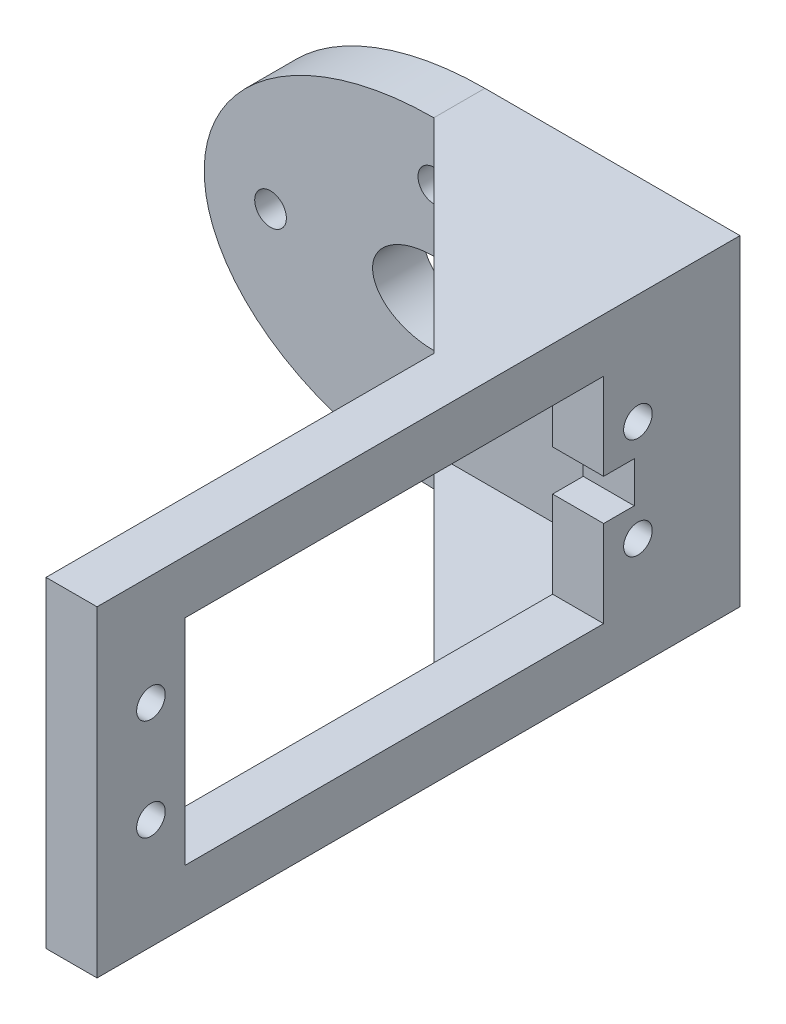
ISO-10303-21;
HEADER;
FILE_DESCRIPTION(('STEP AP214'),'2;1');
FILE_NAME('part.step','',(''),(''),'','','');
FILE_SCHEMA(('AUTOMOTIVE_DESIGN { 1 0 10303 214 1 1 1 1 }'));
ENDSEC;
DATA;
#1=APPLICATION_CONTEXT('core data for automotive mechanical design processes');
#2=APPLICATION_PROTOCOL_DEFINITION('international standard','automotive_design',2000,#1);
#3=PRODUCT_CONTEXT('',#1,'mechanical');
#4=PRODUCT('Part','Part','',(#3));
#5=PRODUCT_RELATED_PRODUCT_CATEGORY('part','',(#4));
#6=PRODUCT_DEFINITION_FORMATION('','',#4);
#7=PRODUCT_DEFINITION_CONTEXT('part definition',#1,'design');
#8=PRODUCT_DEFINITION('design','',#6,#7);
#9=PRODUCT_DEFINITION_SHAPE('','',#8);
#10=(LENGTH_UNIT() NAMED_UNIT(*) SI_UNIT(.MILLI.,.METRE.));
#11=(NAMED_UNIT(*) PLANE_ANGLE_UNIT() SI_UNIT($,.RADIAN.));
#12=(NAMED_UNIT(*) SI_UNIT($,.STERADIAN.) SOLID_ANGLE_UNIT());
#13=UNCERTAINTY_MEASURE_WITH_UNIT(LENGTH_MEASURE(1.E-05),#10,'distance_accuracy_value','');
#14=(GEOMETRIC_REPRESENTATION_CONTEXT(3) GLOBAL_UNCERTAINTY_ASSIGNED_CONTEXT((#13)) GLOBAL_UNIT_ASSIGNED_CONTEXT((#10,
#11,#12)) REPRESENTATION_CONTEXT('',''));
#15=CARTESIAN_POINT('',(0.,0.,0.));
#16=DIRECTION('',(0.,0.,1.));
#17=DIRECTION('',(1.,0.,0.));
#18=AXIS2_PLACEMENT_3D('',#15,#16,#17);
#19=CARTESIAN_POINT('',(0.,0.,5.));
#20=DIRECTION('',(0.,0.,1.));
#21=DIRECTION('',(1.,0.,0.));
#22=AXIS2_PLACEMENT_3D('',#19,#20,#21);
#23=PLANE('',#22);
#24=CARTESIAN_POINT('',(0.,-10.,5.));
#25=DIRECTION('',(0.,0.,1.));
#26=DIRECTION('',(1.,0.,0.));
#27=AXIS2_PLACEMENT_3D('',#24,#25,#26);
#28=CIRCLE('',#27,1.55);
#29=CARTESIAN_POINT('',(1.55,-10.,5.));
#30=VERTEX_POINT('',#29);
#31=EDGE_CURVE('E353',#30,#30,#28,.T.);
#32=ORIENTED_EDGE('',*,*,#31,.F.);
#33=EDGE_LOOP('',(#32));
#34=FACE_BOUND('',#33,.T.);
#35=CARTESIAN_POINT('',(-16.,0.,5.));
#36=DIRECTION('',(0.,0.,1.));
#37=DIRECTION('',(1.,0.,0.));
#38=AXIS2_PLACEMENT_3D('',#35,#36,#37);
#39=CIRCLE('',#38,1.55);
#40=CARTESIAN_POINT('',(-14.45,0.,5.));
#41=VERTEX_POINT('',#40);
#42=EDGE_CURVE('E839',#41,#41,#39,.T.);
#43=ORIENTED_EDGE('',*,*,#42,.F.);
#44=EDGE_LOOP('',(#43));
#45=FACE_BOUND('',#44,.T.);
#46=CARTESIAN_POINT('',(16.,0.,5.));
#47=DIRECTION('',(0.,0.,1.));
#48=DIRECTION('',(1.,0.,0.));
#49=AXIS2_PLACEMENT_3D('',#46,#47,#48);
#50=CIRCLE('',#49,1.55);
#51=CARTESIAN_POINT('',(17.55,0.,5.));
#52=VERTEX_POINT('',#51);
#53=EDGE_CURVE('E842',#52,#52,#50,.T.);
#54=ORIENTED_EDGE('',*,*,#53,.F.);
#55=EDGE_LOOP('',(#54));
#56=FACE_BOUND('',#55,.T.);
#57=CARTESIAN_POINT('',(0.,10.,5.));
#58=DIRECTION('',(0.,0.,1.));
#59=DIRECTION('',(1.,0.,0.));
#60=AXIS2_PLACEMENT_3D('',#57,#58,#59);
#61=CIRCLE('',#60,1.55);
#62=CARTESIAN_POINT('',(1.55,10.,5.));
#63=VERTEX_POINT('',#62);
#64=EDGE_CURVE('E396',#63,#63,#61,.T.);
#65=ORIENTED_EDGE('',*,*,#64,.F.);
#66=EDGE_LOOP('',(#65));
#67=FACE_BOUND('',#66,.T.);
#68=CARTESIAN_POINT('',(0.,0.,5.));
#69=DIRECTION('',(0.,0.,1.));
#70=DIRECTION('',(1.,0.,0.));
#71=AXIS2_PLACEMENT_3D('',#68,#69,#70);
#72=ELLIPSE('',#71,6.,4.);
#73=CARTESIAN_POINT('',(6.,0.,5.));
#74=VERTEX_POINT('',#73);
#75=EDGE_CURVE('E389',#74,#74,#72,.T.);
#76=ORIENTED_EDGE('',*,*,#75,.F.);
#77=EDGE_LOOP('',(#76));
#78=FACE_BOUND('',#77,.T.);
#79=CARTESIAN_POINT('',(0.,0.,5.));
#80=DIRECTION('',(0.,0.,1.));
#81=DIRECTION('',(1.,0.,0.));
#82=AXIS2_PLACEMENT_3D('',#79,#80,#81);
#83=ELLIPSE('',#82,22.5,15.75);
#84=CARTESIAN_POINT('',(0.,15.75,5.));
#85=VERTEX_POINT('',#84);
#86=CARTESIAN_POINT('',(0.,-15.75,5.));
#87=VERTEX_POINT('',#86);
#88=EDGE_CURVE('E348',#85,#87,#83,.T.);
#89=ORIENTED_EDGE('',*,*,#88,.T.);
#90=DIRECTION('',(0.,-1.,0.));
#91=VECTOR('',#90,1.);
#92=CARTESIAN_POINT('',(0.,-12.75,5.));
#93=LINE('',#92,#91);
#94=CARTESIAN_POINT('',(0.,-12.75,5.));
#95=VERTEX_POINT('',#94);
#96=EDGE_CURVE('E260',#95,#87,#93,.T.);
#97=ORIENTED_EDGE('',*,*,#96,.F.);
#98=DIRECTION('',(-1.,0.,0.));
#99=VECTOR('',#98,1.);
#100=CARTESIAN_POINT('',(0.,-12.75,5.));
#101=LINE('',#100,#99);
#102=CARTESIAN_POINT('',(20.,-12.75,5.));
#103=VERTEX_POINT('',#102);
#104=EDGE_CURVE('E254',#103,#95,#101,.T.);
#105=ORIENTED_EDGE('',*,*,#104,.F.);
#106=DIRECTION('',(0.,-1.,0.));
#107=VECTOR('',#106,1.);
#108=CARTESIAN_POINT('',(20.,15.75,5.));
#109=LINE('',#108,#107);
#110=CARTESIAN_POINT('',(20.,12.75,5.));
#111=VERTEX_POINT('',#110);
#112=EDGE_CURVE('E319',#111,#103,#109,.T.);
#113=ORIENTED_EDGE('',*,*,#112,.F.);
#114=DIRECTION('',(-1.,0.,0.));
#115=VECTOR('',#114,1.);
#116=CARTESIAN_POINT('',(0.,12.75,5.));
#117=LINE('',#116,#115);
#118=CARTESIAN_POINT('',(0.,12.75,5.));
#119=VERTEX_POINT('',#118);
#120=EDGE_CURVE('E277',#111,#119,#117,.T.);
#121=ORIENTED_EDGE('',*,*,#120,.T.);
#122=DIRECTION('',(0.,1.,0.));
#123=VECTOR('',#122,1.);
#124=CARTESIAN_POINT('',(0.,12.75,5.));
#125=LINE('',#124,#123);
#126=EDGE_CURVE('E284',#119,#85,#125,.T.);
#127=ORIENTED_EDGE('',*,*,#126,.T.);
#128=EDGE_LOOP('',(#89,#97,#105,#113,#121,#127));
#129=FACE_BOUND('',#128,.T.);
#130=ADVANCED_FACE('F44',(#34,#45,#56,#67,#78,#129),#23,.T.);
#131=CARTESIAN_POINT('',(20.,15.75,63.));
#132=DIRECTION('',(1.,0.,0.));
#133=DIRECTION('',(0.,1.,0.));
#134=AXIS2_PLACEMENT_3D('',#131,#132,#133);
#135=PLANE('',#134);
#136=DIRECTION('',(0.,-1.,0.));
#137=VECTOR('',#136,1.);
#138=CARTESIAN_POINT('',(20.,0.,10.36));
#139=LINE('',#138,#137);
#140=CARTESIAN_POINT('',(20.,2.,10.36));
#141=VERTEX_POINT('',#140);
#142=CARTESIAN_POINT('',(20.,-2.,10.36));
#143=VERTEX_POINT('',#142);
#144=EDGE_CURVE('E210',#141,#143,#139,.T.);
#145=ORIENTED_EDGE('',*,*,#144,.F.);
#146=DIRECTION('',(0.,0.,-1.));
#147=VECTOR('',#146,1.);
#148=CARTESIAN_POINT('',(20.,2.,0.));
#149=LINE('',#148,#147);
#150=CARTESIAN_POINT('',(20.,2.,13.36));
#151=VERTEX_POINT('',#150);
#152=EDGE_CURVE('E60',#151,#141,#149,.T.);
#153=ORIENTED_EDGE('',*,*,#152,.F.);
#154=DIRECTION('',(0.,1.,0.));
#155=VECTOR('',#154,1.);
#156=CARTESIAN_POINT('',(20.,0.,13.36));
#157=LINE('',#156,#155);
#158=CARTESIAN_POINT('',(20.,10.5,13.36));
#159=VERTEX_POINT('',#158);
#160=EDGE_CURVE('E184',#151,#159,#157,.T.);
#161=ORIENTED_EDGE('',*,*,#160,.T.);
#162=DIRECTION('',(0.,0.,1.));
#163=VECTOR('',#162,1.);
#164=CARTESIAN_POINT('',(20.,10.5,0.));
#165=LINE('',#164,#163);
#166=CARTESIAN_POINT('',(20.,10.5,54.36));
#167=VERTEX_POINT('',#166);
#168=EDGE_CURVE('E188',#159,#167,#165,.T.);
#169=ORIENTED_EDGE('',*,*,#168,.T.);
#170=DIRECTION('',(0.,1.,0.));
#171=VECTOR('',#170,1.);
#172=CARTESIAN_POINT('',(20.,0.,54.36));
#173=LINE('',#172,#171);
#174=CARTESIAN_POINT('',(20.,-10.5,54.36));
#175=VERTEX_POINT('',#174);
#176=EDGE_CURVE('E223',#175,#167,#173,.T.);
#177=ORIENTED_EDGE('',*,*,#176,.F.);
#178=DIRECTION('',(0.,0.,1.));
#179=VECTOR('',#178,1.);
#180=CARTESIAN_POINT('',(20.,-10.5,0.));
#181=LINE('',#180,#179);
#182=CARTESIAN_POINT('',(20.,-10.5,13.36));
#183=VERTEX_POINT('',#182);
#184=EDGE_CURVE('E219',#183,#175,#181,.T.);
#185=ORIENTED_EDGE('',*,*,#184,.F.);
#186=CARTESIAN_POINT('',(20.,-2.,13.36));
#187=VERTEX_POINT('',#186);
#188=EDGE_CURVE('E190',#183,#187,#157,.T.);
#189=ORIENTED_EDGE('',*,*,#188,.T.);
#190=DIRECTION('',(0.,0.,-1.));
#191=VECTOR('',#190,1.);
#192=CARTESIAN_POINT('',(20.,-2.,0.));
#193=LINE('',#192,#191);
#194=EDGE_CURVE('E213',#187,#143,#193,.T.);
#195=ORIENTED_EDGE('',*,*,#194,.T.);
#196=EDGE_LOOP('',(#145,#153,#161,#169,#177,#185,#189,#195));
#197=FACE_BOUND('',#196,.T.);
#198=CARTESIAN_POINT('',(20.,4.96,10.));
#199=DIRECTION('',(-1.,0.,0.));
#200=DIRECTION('',(0.,-1.,0.));
#201=AXIS2_PLACEMENT_3D('',#198,#199,#200);
#202=CIRCLE('',#201,1.4);
#203=CARTESIAN_POINT('',(20.,3.56,10.));
#204=VERTEX_POINT('',#203);
#205=EDGE_CURVE('E295',#204,#204,#202,.T.);
#206=ORIENTED_EDGE('',*,*,#205,.F.);
#207=EDGE_LOOP('',(#206));
#208=FACE_BOUND('',#207,.T.);
#209=CARTESIAN_POINT('',(20.,-4.96,10.));
#210=DIRECTION('',(-1.,0.,0.));
#211=DIRECTION('',(0.,-1.,0.));
#212=AXIS2_PLACEMENT_3D('',#209,#210,#211);
#213=CIRCLE('',#212,1.4);
#214=CARTESIAN_POINT('',(20.,-6.36,10.));
#215=VERTEX_POINT('',#214);
#216=EDGE_CURVE('E291',#215,#215,#213,.T.);
#217=ORIENTED_EDGE('',*,*,#216,.F.);
#218=EDGE_LOOP('',(#217));
#219=FACE_BOUND('',#218,.T.);
#220=CARTESIAN_POINT('',(20.,-4.96,57.72));
#221=DIRECTION('',(-1.,0.,0.));
#222=DIRECTION('',(0.,-1.,0.));
#223=AXIS2_PLACEMENT_3D('',#220,#221,#222);
#224=CIRCLE('',#223,1.4);
#225=CARTESIAN_POINT('',(20.,-6.35999999999999,57.72));
#226=VERTEX_POINT('',#225);
#227=EDGE_CURVE('E300',#226,#226,#224,.T.);
#228=ORIENTED_EDGE('',*,*,#227,.F.);
#229=EDGE_LOOP('',(#228));
#230=FACE_BOUND('',#229,.T.);
#231=CARTESIAN_POINT('',(20.,4.96,57.72));
#232=DIRECTION('',(-1.,0.,0.));
#233=DIRECTION('',(0.,-1.,0.));
#234=AXIS2_PLACEMENT_3D('',#231,#232,#233);
#235=CIRCLE('',#234,1.4);
#236=CARTESIAN_POINT('',(20.,3.56000000000001,57.72));
#237=VERTEX_POINT('',#236);
#238=EDGE_CURVE('E308',#237,#237,#235,.T.);
#239=ORIENTED_EDGE('',*,*,#238,.F.);
#240=EDGE_LOOP('',(#239));
#241=FACE_BOUND('',#240,.T.);
#242=DIRECTION('',(0.,-1.,0.));
#243=VECTOR('',#242,1.);
#244=CARTESIAN_POINT('',(20.,-12.75,25.));
#245=LINE('',#244,#243);
#246=CARTESIAN_POINT('',(20.,-12.75,25.));
#247=VERTEX_POINT('',#246);
#248=CARTESIAN_POINT('',(20.,-15.75,25.));
#249=VERTEX_POINT('',#248);
#250=EDGE_CURVE('E263',#247,#249,#245,.T.);
#251=ORIENTED_EDGE('',*,*,#250,.T.);
#252=DIRECTION('',(0.,0.,-1.));
#253=VECTOR('',#252,1.);
#254=CARTESIAN_POINT('',(20.,-15.75,63.));
#255=LINE('',#254,#253);
#256=CARTESIAN_POINT('',(20.,-15.75,63.));
#257=VERTEX_POINT('',#256);
#258=EDGE_CURVE('E337',#257,#249,#255,.T.);
#259=ORIENTED_EDGE('',*,*,#258,.F.);
#260=DIRECTION('',(0.,-1.,0.));
#261=VECTOR('',#260,1.);
#262=CARTESIAN_POINT('',(20.,15.75,63.));
#263=LINE('',#262,#261);
#264=CARTESIAN_POINT('',(20.,15.75,63.));
#265=VERTEX_POINT('',#264);
#266=EDGE_CURVE('E330',#265,#257,#263,.T.);
#267=ORIENTED_EDGE('',*,*,#266,.F.);
#268=DIRECTION('',(0.,0.,-1.));
#269=VECTOR('',#268,1.);
#270=CARTESIAN_POINT('',(20.,15.75,63.));
#271=LINE('',#270,#269);
#272=CARTESIAN_POINT('',(20.,15.75,25.));
#273=VERTEX_POINT('',#272);
#274=EDGE_CURVE('E344',#265,#273,#271,.T.);
#275=ORIENTED_EDGE('',*,*,#274,.T.);
#276=DIRECTION('',(0.,1.,0.));
#277=VECTOR('',#276,1.);
#278=CARTESIAN_POINT('',(20.,12.75,25.));
#279=LINE('',#278,#277);
#280=CARTESIAN_POINT('',(20.,12.75,25.));
#281=VERTEX_POINT('',#280);
#282=EDGE_CURVE('E280',#281,#273,#279,.T.);
#283=ORIENTED_EDGE('',*,*,#282,.F.);
#284=DIRECTION('',(0.,0.,-1.));
#285=VECTOR('',#284,1.);
#286=CARTESIAN_POINT('',(20.,12.75,5.));
#287=LINE('',#286,#285);
#288=EDGE_CURVE('E274',#281,#111,#287,.T.);
#289=ORIENTED_EDGE('',*,*,#288,.T.);
#290=ORIENTED_EDGE('',*,*,#112,.T.);
#291=DIRECTION('',(0.,0.,-1.));
#292=VECTOR('',#291,1.);
#293=CARTESIAN_POINT('',(20.,-12.75,5.));
#294=LINE('',#293,#292);
#295=EDGE_CURVE('E257',#247,#103,#294,.T.);
#296=ORIENTED_EDGE('',*,*,#295,.F.);
#297=EDGE_LOOP('',(#251,#259,#267,#275,#283,#289,#290,#296));
#298=FACE_BOUND('',#297,.T.);
#299=ADVANCED_FACE('F456',(#197,#208,#219,#230,#241,#298),#135,.F.);
#300=CARTESIAN_POINT('',(0.,15.75,5.));
#301=DIRECTION('',(0.,-1.,0.));
#302=DIRECTION('',(1.,0.,0.));
#303=AXIS2_PLACEMENT_3D('',#300,#301,#302);
#304=PLANE('',#303);
#305=DIRECTION('',(0.,0.,-1.));
#306=VECTOR('',#305,1.);
#307=CARTESIAN_POINT('',(0.,15.75,5.));
#308=LINE('',#307,#306);
#309=CARTESIAN_POINT('',(0.,15.75,0.));
#310=VERTEX_POINT('',#309);
#311=EDGE_CURVE('E11',#85,#310,#308,.T.);
#312=ORIENTED_EDGE('',*,*,#311,.F.);
#313=DIRECTION('',(0.707106781186548,0.,0.707106781186547));
#314=VECTOR('',#313,1.);
#315=CARTESIAN_POINT('',(20.,15.75,25.));
#316=LINE('',#315,#314);
#317=EDGE_CURVE('E267',#85,#273,#316,.T.);
#318=ORIENTED_EDGE('',*,*,#317,.T.);
#319=ORIENTED_EDGE('',*,*,#274,.F.);
#320=DIRECTION('',(-1.,0.,0.));
#321=VECTOR('',#320,1.);
#322=CARTESIAN_POINT('',(25.,15.75,63.));
#323=LINE('',#322,#321);
#324=CARTESIAN_POINT('',(25.,15.75,63.));
#325=VERTEX_POINT('',#324);
#326=EDGE_CURVE('E327',#325,#265,#323,.T.);
#327=ORIENTED_EDGE('',*,*,#326,.F.);
#328=DIRECTION('',(0.,0.,-1.));
#329=VECTOR('',#328,1.);
#330=CARTESIAN_POINT('',(25.,15.75,5.));
#331=LINE('',#330,#329);
#332=CARTESIAN_POINT('',(25.,15.75,0.));
#333=VERTEX_POINT('',#332);
#334=EDGE_CURVE('E395',#325,#333,#331,.T.);
#335=ORIENTED_EDGE('',*,*,#334,.T.);
#336=DIRECTION('',(-1.,0.,0.));
#337=VECTOR('',#336,1.);
#338=CARTESIAN_POINT('',(0.,15.75,0.));
#339=LINE('',#338,#337);
#340=EDGE_CURVE('E347',#333,#310,#339,.T.);
#341=ORIENTED_EDGE('',*,*,#340,.T.);
#342=EDGE_LOOP('',(#312,#318,#319,#327,#335,#341));
#343=FACE_BOUND('',#342,.T.);
#344=ADVANCED_FACE('F46',(#343),#304,.F.);
#345=DIRECTION('',(0.,0.,-1.));
#346=VECTOR('',#345,1.);
#347=SURFACE_OF_LINEAR_EXTRUSION('',#83,#346);
#348=CARTESIAN_POINT('',(0.,0.,0.));
#349=DIRECTION('',(0.,0.,1.));
#350=DIRECTION('',(1.,0.,0.));
#351=AXIS2_PLACEMENT_3D('',#348,#349,#350);
#352=ELLIPSE('',#351,22.5,15.75);
#353=CARTESIAN_POINT('',(0.,-15.75,0.));
#354=VERTEX_POINT('',#353);
#355=EDGE_CURVE('E401',#310,#354,#352,.T.);
#356=ORIENTED_EDGE('',*,*,#355,.T.);
#357=DIRECTION('',(0.,0.,-1.));
#358=VECTOR('',#357,1.);
#359=CARTESIAN_POINT('',(0.,-15.75,5.));
#360=LINE('',#359,#358);
#361=EDGE_CURVE('E53',#87,#354,#360,.T.);
#362=ORIENTED_EDGE('',*,*,#361,.F.);
#363=ORIENTED_EDGE('',*,*,#88,.F.);
#364=ORIENTED_EDGE('',*,*,#311,.T.);
#365=EDGE_LOOP('',(#356,#362,#363,#364));
#366=FACE_BOUND('',#365,.T.);
#367=ADVANCED_FACE('F356',(#366),#347,.F.);
#368=CARTESIAN_POINT('',(0.,-15.75,5.));
#369=DIRECTION('',(0.,-1.,0.));
#370=DIRECTION('',(1.,0.,0.));
#371=AXIS2_PLACEMENT_3D('',#368,#369,#370);
#372=PLANE('',#371);
#373=DIRECTION('',(0.707106781186548,0.,0.707106781186547));
#374=VECTOR('',#373,1.);
#375=CARTESIAN_POINT('',(20.,-15.75,25.));
#376=LINE('',#375,#374);
#377=EDGE_CURVE('E233',#87,#249,#376,.T.);
#378=ORIENTED_EDGE('',*,*,#377,.F.);
#379=ORIENTED_EDGE('',*,*,#361,.T.);
#380=DIRECTION('',(-1.,0.,0.));
#381=VECTOR('',#380,1.);
#382=CARTESIAN_POINT('',(0.,-15.75,0.));
#383=LINE('',#382,#381);
#384=CARTESIAN_POINT('',(25.,-15.75,0.));
#385=VERTEX_POINT('',#384);
#386=EDGE_CURVE('E405',#385,#354,#383,.T.);
#387=ORIENTED_EDGE('',*,*,#386,.F.);
#388=DIRECTION('',(0.,0.,-1.));
#389=VECTOR('',#388,1.);
#390=CARTESIAN_POINT('',(25.,-15.75,5.));
#391=LINE('',#390,#389);
#392=CARTESIAN_POINT('',(25.,-15.75,63.));
#393=VERTEX_POINT('',#392);
#394=EDGE_CURVE('E434',#393,#385,#391,.T.);
#395=ORIENTED_EDGE('',*,*,#394,.F.);
#396=DIRECTION('',(1.,0.,0.));
#397=VECTOR('',#396,1.);
#398=CARTESIAN_POINT('',(25.,-15.75,63.));
#399=LINE('',#398,#397);
#400=EDGE_CURVE('E333',#257,#393,#399,.T.);
#401=ORIENTED_EDGE('',*,*,#400,.F.);
#402=ORIENTED_EDGE('',*,*,#258,.T.);
#403=EDGE_LOOP('',(#378,#379,#387,#395,#401,#402));
#404=FACE_BOUND('',#403,.T.);
#405=ADVANCED_FACE('F359',(#404),#372,.T.);
#406=CARTESIAN_POINT('',(0.,10.,5.));
#407=DIRECTION('',(0.,0.,-1.));
#408=DIRECTION('',(-1.,0.,0.));
#409=AXIS2_PLACEMENT_3D('',#406,#407,#408);
#410=CYLINDRICAL_SURFACE('',#409,1.55);
#411=ORIENTED_EDGE('',*,*,#64,.T.);
#412=EDGE_LOOP('',(#411));
#413=FACE_BOUND('',#412,.T.);
#414=CARTESIAN_POINT('',(0.,10.,0.));
#415=DIRECTION('',(0.,0.,1.));
#416=DIRECTION('',(1.,0.,0.));
#417=AXIS2_PLACEMENT_3D('',#414,#415,#416);
#418=CIRCLE('',#417,1.55);
#419=CARTESIAN_POINT('',(1.55,10.,0.));
#420=VERTEX_POINT('',#419);
#421=EDGE_CURVE('E425',#420,#420,#418,.T.);
#422=ORIENTED_EDGE('',*,*,#421,.F.);
#423=EDGE_LOOP('',(#422));
#424=FACE_BOUND('',#423,.T.);
#425=ADVANCED_FACE('F363',(#413,#424),#410,.F.);
#426=CARTESIAN_POINT('',(16.,0.,5.));
#427=DIRECTION('',(0.,0.,-1.));
#428=DIRECTION('',(-1.,0.,0.));
#429=AXIS2_PLACEMENT_3D('',#426,#427,#428);
#430=CYLINDRICAL_SURFACE('',#429,1.55);
#431=ORIENTED_EDGE('',*,*,#53,.T.);
#432=EDGE_LOOP('',(#431));
#433=FACE_BOUND('',#432,.T.);
#434=CARTESIAN_POINT('',(16.,0.,0.));
#435=DIRECTION('',(0.,0.,1.));
#436=DIRECTION('',(1.,0.,0.));
#437=AXIS2_PLACEMENT_3D('',#434,#435,#436);
#438=CIRCLE('',#437,1.55);
#439=CARTESIAN_POINT('',(17.55,0.,0.));
#440=VERTEX_POINT('',#439);
#441=EDGE_CURVE('E421',#440,#440,#438,.T.);
#442=ORIENTED_EDGE('',*,*,#441,.F.);
#443=EDGE_LOOP('',(#442));
#444=FACE_BOUND('',#443,.T.);
#445=ADVANCED_FACE('F375',(#433,#444),#430,.F.);
#446=CARTESIAN_POINT('',(-16.,0.,5.));
#447=DIRECTION('',(0.,0.,-1.));
#448=DIRECTION('',(-1.,0.,0.));
#449=AXIS2_PLACEMENT_3D('',#446,#447,#448);
#450=CYLINDRICAL_SURFACE('',#449,1.55);
#451=ORIENTED_EDGE('',*,*,#42,.T.);
#452=EDGE_LOOP('',(#451));
#453=FACE_BOUND('',#452,.T.);
#454=CARTESIAN_POINT('',(-16.,0.,0.));
#455=DIRECTION('',(0.,0.,1.));
#456=DIRECTION('',(1.,0.,0.));
#457=AXIS2_PLACEMENT_3D('',#454,#455,#456);
#458=CIRCLE('',#457,1.55);
#459=CARTESIAN_POINT('',(-14.45,0.,0.));
#460=VERTEX_POINT('',#459);
#461=EDGE_CURVE('E417',#460,#460,#458,.T.);
#462=ORIENTED_EDGE('',*,*,#461,.F.);
#463=EDGE_LOOP('',(#462));
#464=FACE_BOUND('',#463,.T.);
#465=ADVANCED_FACE('F371',(#453,#464),#450,.F.);
#466=CARTESIAN_POINT('',(0.,-10.,5.));
#467=DIRECTION('',(0.,0.,-1.));
#468=DIRECTION('',(-1.,0.,0.));
#469=AXIS2_PLACEMENT_3D('',#466,#467,#468);
#470=CYLINDRICAL_SURFACE('',#469,1.55);
#471=ORIENTED_EDGE('',*,*,#31,.T.);
#472=EDGE_LOOP('',(#471));
#473=FACE_BOUND('',#472,.T.);
#474=CARTESIAN_POINT('',(0.,-10.,0.));
#475=DIRECTION('',(0.,0.,1.));
#476=DIRECTION('',(1.,0.,0.));
#477=AXIS2_PLACEMENT_3D('',#474,#475,#476);
#478=CIRCLE('',#477,1.55);
#479=CARTESIAN_POINT('',(1.55,-10.,0.));
#480=VERTEX_POINT('',#479);
#481=EDGE_CURVE('E413',#480,#480,#478,.T.);
#482=ORIENTED_EDGE('',*,*,#481,.F.);
#483=EDGE_LOOP('',(#482));
#484=FACE_BOUND('',#483,.T.);
#485=ADVANCED_FACE('F368',(#473,#484),#470,.F.);
#486=CARTESIAN_POINT('',(25.,0.,5.));
#487=DIRECTION('',(1.,0.,0.));
#488=DIRECTION('',(0.,0.,-1.));
#489=AXIS2_PLACEMENT_3D('',#486,#487,#488);
#490=PLANE('',#489);
#491=DIRECTION('',(0.,0.,-1.));
#492=VECTOR('',#491,1.);
#493=CARTESIAN_POINT('',(25.,2.,0.));
#494=LINE('',#493,#492);
#495=CARTESIAN_POINT('',(25.,2.,13.36));
#496=VERTEX_POINT('',#495);
#497=CARTESIAN_POINT('',(25.,2.,10.36));
#498=VERTEX_POINT('',#497);
#499=EDGE_CURVE('E166',#496,#498,#494,.T.);
#500=ORIENTED_EDGE('',*,*,#499,.T.);
#501=DIRECTION('',(0.,-1.,0.));
#502=VECTOR('',#501,1.);
#503=CARTESIAN_POINT('',(25.,0.,10.36));
#504=LINE('',#503,#502);
#505=CARTESIAN_POINT('',(25.,-2.,10.36));
#506=VERTEX_POINT('',#505);
#507=EDGE_CURVE('E173',#498,#506,#504,.T.);
#508=ORIENTED_EDGE('',*,*,#507,.T.);
#509=DIRECTION('',(0.,0.,-1.));
#510=VECTOR('',#509,1.);
#511=CARTESIAN_POINT('',(25.,-2.,0.));
#512=LINE('',#511,#510);
#513=CARTESIAN_POINT('',(25.,-2.,13.36));
#514=VERTEX_POINT('',#513);
#515=EDGE_CURVE('E178',#514,#506,#512,.T.);
#516=ORIENTED_EDGE('',*,*,#515,.F.);
#517=DIRECTION('',(0.,1.,0.));
#518=VECTOR('',#517,1.);
#519=CARTESIAN_POINT('',(25.,0.,13.36));
#520=LINE('',#519,#518);
#521=CARTESIAN_POINT('',(25.,-10.5,13.36));
#522=VERTEX_POINT('',#521);
#523=EDGE_CURVE('E194',#522,#514,#520,.T.);
#524=ORIENTED_EDGE('',*,*,#523,.F.);
#525=DIRECTION('',(0.,0.,1.));
#526=VECTOR('',#525,1.);
#527=CARTESIAN_POINT('',(25.,-10.5,0.));
#528=LINE('',#527,#526);
#529=CARTESIAN_POINT('',(25.,-10.5,54.36));
#530=VERTEX_POINT('',#529);
#531=EDGE_CURVE('E197',#522,#530,#528,.T.);
#532=ORIENTED_EDGE('',*,*,#531,.T.);
#533=DIRECTION('',(0.,1.,0.));
#534=VECTOR('',#533,1.);
#535=CARTESIAN_POINT('',(25.,0.,54.36));
#536=LINE('',#535,#534);
#537=CARTESIAN_POINT('',(25.,10.5,54.36));
#538=VERTEX_POINT('',#537);
#539=EDGE_CURVE('E201',#530,#538,#536,.T.);
#540=ORIENTED_EDGE('',*,*,#539,.T.);
#541=DIRECTION('',(0.,0.,1.));
#542=VECTOR('',#541,1.);
#543=CARTESIAN_POINT('',(25.,10.5,0.));
#544=LINE('',#543,#542);
#545=CARTESIAN_POINT('',(25.,10.5,13.36));
#546=VERTEX_POINT('',#545);
#547=EDGE_CURVE('E205',#546,#538,#544,.T.);
#548=ORIENTED_EDGE('',*,*,#547,.F.);
#549=EDGE_CURVE('E170',#496,#546,#520,.T.);
#550=ORIENTED_EDGE('',*,*,#549,.F.);
#551=EDGE_LOOP('',(#500,#508,#516,#524,#532,#540,#548,#550));
#552=FACE_BOUND('',#551,.T.);
#553=CARTESIAN_POINT('',(25.,4.96,57.72));
#554=DIRECTION('',(-1.,0.,0.));
#555=DIRECTION('',(0.,-1.,0.));
#556=AXIS2_PLACEMENT_3D('',#553,#554,#555);
#557=CIRCLE('',#556,1.4);
#558=CARTESIAN_POINT('',(25.,3.56000000000001,57.72));
#559=VERTEX_POINT('',#558);
#560=EDGE_CURVE('E287',#559,#559,#557,.T.);
#561=ORIENTED_EDGE('',*,*,#560,.T.);
#562=EDGE_LOOP('',(#561));
#563=FACE_BOUND('',#562,.T.);
#564=CARTESIAN_POINT('',(25.,-4.96,57.72));
#565=DIRECTION('',(-1.,0.,0.));
#566=DIRECTION('',(0.,-1.,0.));
#567=AXIS2_PLACEMENT_3D('',#564,#565,#566);
#568=CIRCLE('',#567,1.4);
#569=CARTESIAN_POINT('',(25.,-6.35999999999999,57.72));
#570=VERTEX_POINT('',#569);
#571=EDGE_CURVE('E304',#570,#570,#568,.T.);
#572=ORIENTED_EDGE('',*,*,#571,.T.);
#573=EDGE_LOOP('',(#572));
#574=FACE_BOUND('',#573,.T.);
#575=CARTESIAN_POINT('',(25.,-4.96,10.));
#576=DIRECTION('',(-1.,0.,0.));
#577=DIRECTION('',(0.,-1.,0.));
#578=AXIS2_PLACEMENT_3D('',#575,#576,#577);
#579=CIRCLE('',#578,1.4);
#580=CARTESIAN_POINT('',(25.,-6.36,10.));
#581=VERTEX_POINT('',#580);
#582=EDGE_CURVE('E296',#581,#581,#579,.T.);
#583=ORIENTED_EDGE('',*,*,#582,.T.);
#584=EDGE_LOOP('',(#583));
#585=FACE_BOUND('',#584,.T.);
#586=CARTESIAN_POINT('',(25.,4.96,10.));
#587=DIRECTION('',(-1.,0.,0.));
#588=DIRECTION('',(0.,-1.,0.));
#589=AXIS2_PLACEMENT_3D('',#586,#587,#588);
#590=CIRCLE('',#589,1.4);
#591=CARTESIAN_POINT('',(25.,3.56,10.));
#592=VERTEX_POINT('',#591);
#593=EDGE_CURVE('E315',#592,#592,#590,.T.);
#594=ORIENTED_EDGE('',*,*,#593,.T.);
#595=EDGE_LOOP('',(#594));
#596=FACE_BOUND('',#595,.T.);
#597=DIRECTION('',(0.,-1.,0.));
#598=VECTOR('',#597,1.);
#599=CARTESIAN_POINT('',(25.,0.,0.));
#600=LINE('',#599,#598);
#601=EDGE_CURVE('E409',#333,#385,#600,.T.);
#602=ORIENTED_EDGE('',*,*,#601,.F.);
#603=ORIENTED_EDGE('',*,*,#334,.F.);
#604=DIRECTION('',(0.,1.,0.));
#605=VECTOR('',#604,1.);
#606=CARTESIAN_POINT('',(25.,15.75,63.));
#607=LINE('',#606,#605);
#608=EDGE_CURVE('E323',#393,#325,#607,.T.);
#609=ORIENTED_EDGE('',*,*,#608,.F.);
#610=ORIENTED_EDGE('',*,*,#394,.T.);
#611=EDGE_LOOP('',(#602,#603,#609,#610));
#612=FACE_BOUND('',#611,.T.);
#613=ADVANCED_FACE('F180',(#552,#563,#574,#585,#596,#612),#490,.T.);
#614=DIRECTION('',(0.,0.,-1.));
#615=VECTOR('',#614,1.);
#616=SURFACE_OF_LINEAR_EXTRUSION('',#72,#615);
#617=ORIENTED_EDGE('',*,*,#75,.T.);
#618=EDGE_LOOP('',(#617));
#619=FACE_BOUND('',#618,.T.);
#620=CARTESIAN_POINT('',(0.,0.,0.));
#621=DIRECTION('',(0.,0.,1.));
#622=DIRECTION('',(1.,0.,0.));
#623=AXIS2_PLACEMENT_3D('',#620,#621,#622);
#624=ELLIPSE('',#623,6.,4.);
#625=CARTESIAN_POINT('',(6.,0.,0.));
#626=VERTEX_POINT('',#625);
#627=EDGE_CURVE('E354',#626,#626,#624,.T.);
#628=ORIENTED_EDGE('',*,*,#627,.F.);
#629=EDGE_LOOP('',(#628));
#630=FACE_BOUND('',#629,.T.);
#631=ADVANCED_FACE('F367',(#619,#630),#616,.T.);
#632=CARTESIAN_POINT('',(0.,0.,0.));
#633=DIRECTION('',(0.,0.,1.));
#634=DIRECTION('',(1.,0.,0.));
#635=AXIS2_PLACEMENT_3D('',#632,#633,#634);
#636=PLANE('',#635);
#637=ORIENTED_EDGE('',*,*,#340,.F.);
#638=ORIENTED_EDGE('',*,*,#601,.T.);
#639=ORIENTED_EDGE('',*,*,#386,.T.);
#640=ORIENTED_EDGE('',*,*,#355,.F.);
#641=EDGE_LOOP('',(#637,#638,#639,#640));
#642=FACE_BOUND('',#641,.T.);
#643=ORIENTED_EDGE('',*,*,#481,.T.);
#644=EDGE_LOOP('',(#643));
#645=FACE_BOUND('',#644,.T.);
#646=ORIENTED_EDGE('',*,*,#461,.T.);
#647=EDGE_LOOP('',(#646));
#648=FACE_BOUND('',#647,.T.);
#649=ORIENTED_EDGE('',*,*,#441,.T.);
#650=EDGE_LOOP('',(#649));
#651=FACE_BOUND('',#650,.T.);
#652=ORIENTED_EDGE('',*,*,#421,.T.);
#653=EDGE_LOOP('',(#652));
#654=FACE_BOUND('',#653,.T.);
#655=ORIENTED_EDGE('',*,*,#627,.T.);
#656=EDGE_LOOP('',(#655));
#657=FACE_BOUND('',#656,.T.);
#658=ADVANCED_FACE('F386',(#642,#645,#648,#651,#654,#657),#636,.F.);
#659=CARTESIAN_POINT('',(0.,0.,63.));
#660=DIRECTION('',(0.,0.,-1.));
#661=DIRECTION('',(-1.,0.,0.));
#662=AXIS2_PLACEMENT_3D('',#659,#660,#661);
#663=PLANE('',#662);
#664=ORIENTED_EDGE('',*,*,#608,.T.);
#665=ORIENTED_EDGE('',*,*,#326,.T.);
#666=ORIENTED_EDGE('',*,*,#266,.T.);
#667=ORIENTED_EDGE('',*,*,#400,.T.);
#668=EDGE_LOOP('',(#664,#665,#666,#667));
#669=FACE_BOUND('',#668,.T.);
#670=ADVANCED_FACE('F451',(#669),#663,.F.);
#671=CARTESIAN_POINT('',(25.,4.96,10.));
#672=DIRECTION('',(-1.,0.,0.));
#673=DIRECTION('',(0.,-1.,0.));
#674=AXIS2_PLACEMENT_3D('',#671,#672,#673);
#675=CYLINDRICAL_SURFACE('',#674,1.4);
#676=ORIENTED_EDGE('',*,*,#593,.F.);
#677=EDGE_LOOP('',(#676));
#678=FACE_BOUND('',#677,.T.);
#679=ORIENTED_EDGE('',*,*,#205,.T.);
#680=EDGE_LOOP('',(#679));
#681=FACE_BOUND('',#680,.T.);
#682=ADVANCED_FACE('F498',(#678,#681),#675,.F.);
#683=CARTESIAN_POINT('',(25.,-4.96,10.));
#684=DIRECTION('',(-1.,0.,0.));
#685=DIRECTION('',(0.,-1.,0.));
#686=AXIS2_PLACEMENT_3D('',#683,#684,#685);
#687=CYLINDRICAL_SURFACE('',#686,1.4);
#688=ORIENTED_EDGE('',*,*,#582,.F.);
#689=EDGE_LOOP('',(#688));
#690=FACE_BOUND('',#689,.T.);
#691=ORIENTED_EDGE('',*,*,#216,.T.);
#692=EDGE_LOOP('',(#691));
#693=FACE_BOUND('',#692,.T.);
#694=ADVANCED_FACE('F501',(#690,#693),#687,.F.);
#695=CARTESIAN_POINT('',(25.,-4.96,57.72));
#696=DIRECTION('',(-1.,0.,0.));
#697=DIRECTION('',(0.,-1.,0.));
#698=AXIS2_PLACEMENT_3D('',#695,#696,#697);
#699=CYLINDRICAL_SURFACE('',#698,1.4);
#700=ORIENTED_EDGE('',*,*,#571,.F.);
#701=EDGE_LOOP('',(#700));
#702=FACE_BOUND('',#701,.T.);
#703=ORIENTED_EDGE('',*,*,#227,.T.);
#704=EDGE_LOOP('',(#703));
#705=FACE_BOUND('',#704,.T.);
#706=ADVANCED_FACE('F505',(#702,#705),#699,.F.);
#707=CARTESIAN_POINT('',(25.,4.96,57.72));
#708=DIRECTION('',(-1.,0.,0.));
#709=DIRECTION('',(0.,-1.,0.));
#710=AXIS2_PLACEMENT_3D('',#707,#708,#709);
#711=CYLINDRICAL_SURFACE('',#710,1.4);
#712=ORIENTED_EDGE('',*,*,#560,.F.);
#713=EDGE_LOOP('',(#712));
#714=FACE_BOUND('',#713,.T.);
#715=ORIENTED_EDGE('',*,*,#238,.T.);
#716=EDGE_LOOP('',(#715));
#717=FACE_BOUND('',#716,.T.);
#718=ADVANCED_FACE('F484',(#714,#717),#711,.F.);
#719=CARTESIAN_POINT('',(20.,12.75,25.));
#720=DIRECTION('',(-0.707106781186547,0.,0.707106781186548));
#721=DIRECTION('',(0.707106781186548,0.,0.707106781186547));
#722=AXIS2_PLACEMENT_3D('',#719,#720,#721);
#723=PLANE('',#722);
#724=ORIENTED_EDGE('',*,*,#317,.F.);
#725=ORIENTED_EDGE('',*,*,#126,.F.);
#726=DIRECTION('',(0.707106781186548,0.,0.707106781186547));
#727=VECTOR('',#726,1.);
#728=CARTESIAN_POINT('',(20.,12.75,25.));
#729=LINE('',#728,#727);
#730=EDGE_CURVE('E270',#119,#281,#729,.T.);
#731=ORIENTED_EDGE('',*,*,#730,.T.);
#732=ORIENTED_EDGE('',*,*,#282,.T.);
#733=EDGE_LOOP('',(#724,#725,#731,#732));
#734=FACE_BOUND('',#733,.T.);
#735=ADVANCED_FACE('F470',(#734),#723,.T.);
#736=CARTESIAN_POINT('',(0.,12.75,0.));
#737=DIRECTION('',(0.,-1.,0.));
#738=DIRECTION('',(1.,0.,0.));
#739=AXIS2_PLACEMENT_3D('',#736,#737,#738);
#740=PLANE('',#739);
#741=ORIENTED_EDGE('',*,*,#730,.F.);
#742=ORIENTED_EDGE('',*,*,#120,.F.);
#743=ORIENTED_EDGE('',*,*,#288,.F.);
#744=EDGE_LOOP('',(#741,#742,#743));
#745=FACE_BOUND('',#744,.T.);
#746=ADVANCED_FACE('F475',(#745),#740,.T.);
#747=CARTESIAN_POINT('',(20.,-12.75,25.));
#748=DIRECTION('',(0.707106781186547,0.,-0.707106781186548));
#749=DIRECTION('',(-0.707106781186548,0.,-0.707106781186547));
#750=AXIS2_PLACEMENT_3D('',#747,#748,#749);
#751=PLANE('',#750);
#752=ORIENTED_EDGE('',*,*,#377,.T.);
#753=ORIENTED_EDGE('',*,*,#250,.F.);
#754=DIRECTION('',(0.707106781186548,0.,0.707106781186547));
#755=VECTOR('',#754,1.);
#756=CARTESIAN_POINT('',(20.,-12.75,25.));
#757=LINE('',#756,#755);
#758=EDGE_CURVE('E251',#95,#247,#757,.T.);
#759=ORIENTED_EDGE('',*,*,#758,.F.);
#760=ORIENTED_EDGE('',*,*,#96,.T.);
#761=EDGE_LOOP('',(#752,#753,#759,#760));
#762=FACE_BOUND('',#761,.T.);
#763=ADVANCED_FACE('F461',(#762),#751,.F.);
#764=CARTESIAN_POINT('',(0.,-12.75,0.));
#765=DIRECTION('',(0.,1.,0.));
#766=DIRECTION('',(1.,0.,0.));
#767=AXIS2_PLACEMENT_3D('',#764,#765,#766);
#768=PLANE('',#767);
#769=ORIENTED_EDGE('',*,*,#758,.T.);
#770=ORIENTED_EDGE('',*,*,#295,.T.);
#771=ORIENTED_EDGE('',*,*,#104,.T.);
#772=EDGE_LOOP('',(#769,#770,#771));
#773=FACE_BOUND('',#772,.T.);
#774=ADVANCED_FACE('F482',(#773),#768,.T.);
#775=CARTESIAN_POINT('',(25.,2.,0.));
#776=DIRECTION('',(0.,1.,0.));
#777=DIRECTION('',(0.,0.,1.));
#778=AXIS2_PLACEMENT_3D('',#775,#776,#777);
#779=PLANE('',#778);
#780=ORIENTED_EDGE('',*,*,#152,.T.);
#781=DIRECTION('',(-1.,0.,0.));
#782=VECTOR('',#781,1.);
#783=CARTESIAN_POINT('',(25.,2.,10.36));
#784=LINE('',#783,#782);
#785=EDGE_CURVE('E163',#498,#141,#784,.T.);
#786=ORIENTED_EDGE('',*,*,#785,.F.);
#787=ORIENTED_EDGE('',*,*,#499,.F.);
#788=DIRECTION('',(-1.,0.,0.));
#789=VECTOR('',#788,1.);
#790=CARTESIAN_POINT('',(25.,2.,13.36));
#791=LINE('',#790,#789);
#792=EDGE_CURVE('E230',#496,#151,#791,.T.);
#793=ORIENTED_EDGE('',*,*,#792,.T.);
#794=EDGE_LOOP('',(#780,#786,#787,#793));
#795=FACE_BOUND('',#794,.T.);
#796=ADVANCED_FACE('F164',(#795),#779,.F.);
#797=CARTESIAN_POINT('',(25.,0.,13.36));
#798=DIRECTION('',(0.,0.,1.));
#799=DIRECTION('',(1.,0.,0.));
#800=AXIS2_PLACEMENT_3D('',#797,#798,#799);
#801=PLANE('',#800);
#802=ORIENTED_EDGE('',*,*,#160,.F.);
#803=ORIENTED_EDGE('',*,*,#792,.F.);
#804=ORIENTED_EDGE('',*,*,#549,.T.);
#805=DIRECTION('',(-1.,0.,0.));
#806=VECTOR('',#805,1.);
#807=CARTESIAN_POINT('',(25.,10.5,13.36));
#808=LINE('',#807,#806);
#809=EDGE_CURVE('E234',#546,#159,#808,.T.);
#810=ORIENTED_EDGE('',*,*,#809,.T.);
#811=EDGE_LOOP('',(#802,#803,#804,#810));
#812=FACE_BOUND('',#811,.T.);
#813=ADVANCED_FACE('F605',(#812),#801,.T.);
#814=CARTESIAN_POINT('',(25.,10.5,0.));
#815=DIRECTION('',(0.,-1.,0.));
#816=DIRECTION('',(1.,0.,0.));
#817=AXIS2_PLACEMENT_3D('',#814,#815,#816);
#818=PLANE('',#817);
#819=ORIENTED_EDGE('',*,*,#168,.F.);
#820=ORIENTED_EDGE('',*,*,#809,.F.);
#821=ORIENTED_EDGE('',*,*,#547,.T.);
#822=DIRECTION('',(-1.,0.,0.));
#823=VECTOR('',#822,1.);
#824=CARTESIAN_POINT('',(25.,10.5,54.36));
#825=LINE('',#824,#823);
#826=EDGE_CURVE('E237',#538,#167,#825,.T.);
#827=ORIENTED_EDGE('',*,*,#826,.T.);
#828=EDGE_LOOP('',(#819,#820,#821,#827));
#829=FACE_BOUND('',#828,.T.);
#830=ADVANCED_FACE('F614',(#829),#818,.T.);
#831=CARTESIAN_POINT('',(25.,0.,54.36));
#832=DIRECTION('',(0.,0.,1.));
#833=DIRECTION('',(1.,0.,0.));
#834=AXIS2_PLACEMENT_3D('',#831,#832,#833);
#835=PLANE('',#834);
#836=ORIENTED_EDGE('',*,*,#176,.T.);
#837=ORIENTED_EDGE('',*,*,#826,.F.);
#838=ORIENTED_EDGE('',*,*,#539,.F.);
#839=DIRECTION('',(-1.,0.,0.));
#840=VECTOR('',#839,1.);
#841=CARTESIAN_POINT('',(25.,-10.5,54.36));
#842=LINE('',#841,#840);
#843=EDGE_CURVE('E240',#530,#175,#842,.T.);
#844=ORIENTED_EDGE('',*,*,#843,.T.);
#845=EDGE_LOOP('',(#836,#837,#838,#844));
#846=FACE_BOUND('',#845,.T.);
#847=ADVANCED_FACE('F625',(#846),#835,.F.);
#848=CARTESIAN_POINT('',(25.,-10.5,0.));
#849=DIRECTION('',(0.,-1.,0.));
#850=DIRECTION('',(1.,0.,0.));
#851=AXIS2_PLACEMENT_3D('',#848,#849,#850);
#852=PLANE('',#851);
#853=ORIENTED_EDGE('',*,*,#184,.T.);
#854=ORIENTED_EDGE('',*,*,#843,.F.);
#855=ORIENTED_EDGE('',*,*,#531,.F.);
#856=DIRECTION('',(-1.,0.,0.));
#857=VECTOR('',#856,1.);
#858=CARTESIAN_POINT('',(25.,-10.5,13.36));
#859=LINE('',#858,#857);
#860=EDGE_CURVE('E243',#522,#183,#859,.T.);
#861=ORIENTED_EDGE('',*,*,#860,.T.);
#862=EDGE_LOOP('',(#853,#854,#855,#861));
#863=FACE_BOUND('',#862,.T.);
#864=ADVANCED_FACE('F635',(#863),#852,.F.);
#865=ORIENTED_EDGE('',*,*,#188,.F.);
#866=ORIENTED_EDGE('',*,*,#860,.F.);
#867=ORIENTED_EDGE('',*,*,#523,.T.);
#868=DIRECTION('',(-1.,0.,0.));
#869=VECTOR('',#868,1.);
#870=CARTESIAN_POINT('',(25.,-2.,13.36));
#871=LINE('',#870,#869);
#872=EDGE_CURVE('E246',#514,#187,#871,.T.);
#873=ORIENTED_EDGE('',*,*,#872,.T.);
#874=EDGE_LOOP('',(#865,#866,#867,#873));
#875=FACE_BOUND('',#874,.T.);
#876=ADVANCED_FACE('F617',(#875),#801,.T.);
#877=CARTESIAN_POINT('',(25.,-2.,0.));
#878=DIRECTION('',(0.,1.,0.));
#879=DIRECTION('',(0.,0.,1.));
#880=AXIS2_PLACEMENT_3D('',#877,#878,#879);
#881=PLANE('',#880);
#882=ORIENTED_EDGE('',*,*,#194,.F.);
#883=ORIENTED_EDGE('',*,*,#872,.F.);
#884=ORIENTED_EDGE('',*,*,#515,.T.);
#885=DIRECTION('',(-1.,0.,0.));
#886=VECTOR('',#885,1.);
#887=CARTESIAN_POINT('',(25.,-2.,10.36));
#888=LINE('',#887,#886);
#889=EDGE_CURVE('E68',#506,#143,#888,.T.);
#890=ORIENTED_EDGE('',*,*,#889,.T.);
#891=EDGE_LOOP('',(#882,#883,#884,#890));
#892=FACE_BOUND('',#891,.T.);
#893=ADVANCED_FACE('F654',(#892),#881,.T.);
#894=CARTESIAN_POINT('',(25.,0.,10.36));
#895=DIRECTION('',(0.,0.,-1.));
#896=DIRECTION('',(-1.,0.,0.));
#897=AXIS2_PLACEMENT_3D('',#894,#895,#896);
#898=PLANE('',#897);
#899=ORIENTED_EDGE('',*,*,#144,.T.);
#900=ORIENTED_EDGE('',*,*,#889,.F.);
#901=ORIENTED_EDGE('',*,*,#507,.F.);
#902=ORIENTED_EDGE('',*,*,#785,.T.);
#903=EDGE_LOOP('',(#899,#900,#901,#902));
#904=FACE_BOUND('',#903,.T.);
#905=ADVANCED_FACE('F174',(#904),#898,.F.);
#906=CLOSED_SHELL('',(#130,#299,#344,#367,#405,#425,#445,#465,#485,#613,#631,#658,#670,#682,
#694,#706,#718,#735,#746,#763,#774,#796,#813,#830,#847,#864,#876,#893,#905));
#907=MANIFOLD_SOLID_BREP('B2',#906);
#908=ADVANCED_BREP_SHAPE_REPRESENTATION('',(#18,#907),#14);
#909=SHAPE_DEFINITION_REPRESENTATION(#9,#908);
ENDSEC;
END-ISO-10303-21;
